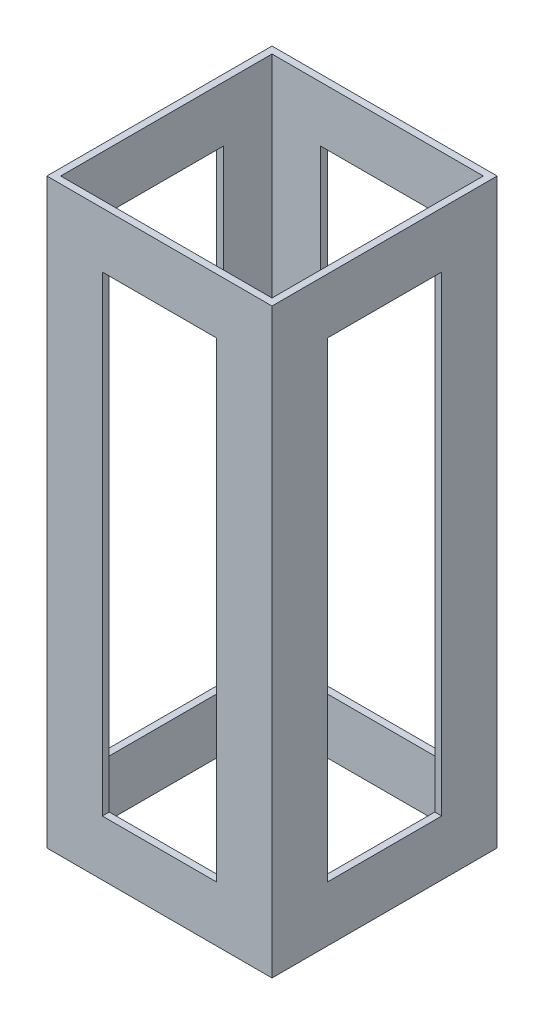
ISO-10303-21;
HEADER;
FILE_DESCRIPTION(('STEP AP214'),'2;1');
FILE_NAME('part.step','',(''),(''),'','','');
FILE_SCHEMA(('AUTOMOTIVE_DESIGN { 1 0 10303 214 1 1 1 1 }'));
ENDSEC;
DATA;
#1=APPLICATION_CONTEXT('core data for automotive mechanical design processes');
#2=APPLICATION_PROTOCOL_DEFINITION('international standard','automotive_design',2000,#1);
#3=PRODUCT_CONTEXT('',#1,'mechanical');
#4=PRODUCT('Part','Part','',(#3));
#5=PRODUCT_RELATED_PRODUCT_CATEGORY('part','',(#4));
#6=PRODUCT_DEFINITION_FORMATION('','',#4);
#7=PRODUCT_DEFINITION_CONTEXT('part definition',#1,'design');
#8=PRODUCT_DEFINITION('design','',#6,#7);
#9=PRODUCT_DEFINITION_SHAPE('','',#8);
#10=(LENGTH_UNIT() NAMED_UNIT(*) SI_UNIT(.MILLI.,.METRE.));
#11=(NAMED_UNIT(*) PLANE_ANGLE_UNIT() SI_UNIT($,.RADIAN.));
#12=(NAMED_UNIT(*) SI_UNIT($,.STERADIAN.) SOLID_ANGLE_UNIT());
#13=UNCERTAINTY_MEASURE_WITH_UNIT(LENGTH_MEASURE(1.E-05),#10,'distance_accuracy_value','');
#14=(GEOMETRIC_REPRESENTATION_CONTEXT(3) GLOBAL_UNCERTAINTY_ASSIGNED_CONTEXT((#13)) GLOBAL_UNIT_ASSIGNED_CONTEXT((#10,
#11,#12)) REPRESENTATION_CONTEXT('',''));
#15=CARTESIAN_POINT('',(0.,0.,0.));
#16=DIRECTION('',(0.,0.,1.));
#17=DIRECTION('',(1.,0.,0.));
#18=AXIS2_PLACEMENT_3D('',#15,#16,#17);
#19=CARTESIAN_POINT('',(0.,266.7,0.));
#20=DIRECTION('',(0.,-1.,0.));
#21=DIRECTION('',(0.,0.,-1.));
#22=AXIS2_PLACEMENT_3D('',#19,#20,#21);
#23=PLANE('',#22);
#24=DIRECTION('',(0.,0.,-1.));
#25=VECTOR('',#24,1.);
#26=CARTESIAN_POINT('',(51.59375,266.7,51.59375));
#27=LINE('',#26,#25);
#28=CARTESIAN_POINT('',(51.59375,266.7,51.59375));
#29=VERTEX_POINT('',#28);
#30=CARTESIAN_POINT('',(51.59375,266.7,-51.59375));
#31=VERTEX_POINT('',#30);
#32=EDGE_CURVE('E381',#29,#31,#27,.T.);
#33=ORIENTED_EDGE('',*,*,#32,.T.);
#34=DIRECTION('',(-1.,0.,0.));
#35=VECTOR('',#34,1.);
#36=CARTESIAN_POINT('',(-51.59375,266.7,-51.59375));
#37=LINE('',#36,#35);
#38=CARTESIAN_POINT('',(-51.59375,266.7,-51.59375));
#39=VERTEX_POINT('',#38);
#40=EDGE_CURVE('E385',#31,#39,#37,.T.);
#41=ORIENTED_EDGE('',*,*,#40,.T.);
#42=DIRECTION('',(0.,0.,1.));
#43=VECTOR('',#42,1.);
#44=CARTESIAN_POINT('',(-51.59375,266.7,51.59375));
#45=LINE('',#44,#43);
#46=CARTESIAN_POINT('',(-51.59375,266.7,51.59375));
#47=VERTEX_POINT('',#46);
#48=EDGE_CURVE('E389',#39,#47,#45,.T.);
#49=ORIENTED_EDGE('',*,*,#48,.T.);
#50=DIRECTION('',(1.,0.,0.));
#51=VECTOR('',#50,1.);
#52=CARTESIAN_POINT('',(-51.59375,266.7,51.59375));
#53=LINE('',#52,#51);
#54=EDGE_CURVE('E392',#47,#29,#53,.T.);
#55=ORIENTED_EDGE('',*,*,#54,.T.);
#56=EDGE_LOOP('',(#33,#41,#49,#55));
#57=FACE_BOUND('',#56,.T.);
#58=DIRECTION('',(0.,0.,1.));
#59=VECTOR('',#58,1.);
#60=CARTESIAN_POINT('',(-48.41875,266.7,48.41875));
#61=LINE('',#60,#59);
#62=CARTESIAN_POINT('',(-48.41875,266.7,-48.41875));
#63=VERTEX_POINT('',#62);
#64=CARTESIAN_POINT('',(-48.41875,266.7,48.41875));
#65=VERTEX_POINT('',#64);
#66=EDGE_CURVE('E338',#63,#65,#61,.T.);
#67=ORIENTED_EDGE('',*,*,#66,.F.);
#68=DIRECTION('',(-1.,0.,0.));
#69=VECTOR('',#68,1.);
#70=CARTESIAN_POINT('',(-48.41875,266.7,-48.41875));
#71=LINE('',#70,#69);
#72=CARTESIAN_POINT('',(48.41875,266.7,-48.41875));
#73=VERTEX_POINT('',#72);
#74=EDGE_CURVE('E349',#73,#63,#71,.T.);
#75=ORIENTED_EDGE('',*,*,#74,.F.);
#76=DIRECTION('',(0.,0.,-1.));
#77=VECTOR('',#76,1.);
#78=CARTESIAN_POINT('',(48.41875,266.7,48.41875));
#79=LINE('',#78,#77);
#80=CARTESIAN_POINT('',(48.41875,266.7,48.41875));
#81=VERTEX_POINT('',#80);
#82=EDGE_CURVE('E345',#81,#73,#79,.T.);
#83=ORIENTED_EDGE('',*,*,#82,.F.);
#84=DIRECTION('',(1.,0.,0.));
#85=VECTOR('',#84,1.);
#86=CARTESIAN_POINT('',(-48.41875,266.7,48.41875));
#87=LINE('',#86,#85);
#88=EDGE_CURVE('E341',#65,#81,#87,.T.);
#89=ORIENTED_EDGE('',*,*,#88,.F.);
#90=EDGE_LOOP('',(#67,#75,#83,#89));
#91=FACE_BOUND('',#90,.T.);
#92=ADVANCED_FACE('F40',(#57,#91),#23,.F.);
#93=CARTESIAN_POINT('',(0.,0.,0.));
#94=DIRECTION('',(0.,-1.,0.));
#95=DIRECTION('',(0.,0.,-1.));
#96=AXIS2_PLACEMENT_3D('',#93,#94,#95);
#97=PLANE('',#96);
#98=DIRECTION('',(0.,0.,-1.));
#99=VECTOR('',#98,1.);
#100=CARTESIAN_POINT('',(51.59375,0.,51.59375));
#101=LINE('',#100,#99);
#102=CARTESIAN_POINT('',(51.59375,0.,51.59375));
#103=VERTEX_POINT('',#102);
#104=CARTESIAN_POINT('',(51.59375,0.,-51.59375));
#105=VERTEX_POINT('',#104);
#106=EDGE_CURVE('E380',#103,#105,#101,.T.);
#107=ORIENTED_EDGE('',*,*,#106,.F.);
#108=DIRECTION('',(1.,0.,0.));
#109=VECTOR('',#108,1.);
#110=CARTESIAN_POINT('',(-51.59375,0.,51.59375));
#111=LINE('',#110,#109);
#112=CARTESIAN_POINT('',(-51.59375,0.,51.59375));
#113=VERTEX_POINT('',#112);
#114=EDGE_CURVE('E386',#113,#103,#111,.T.);
#115=ORIENTED_EDGE('',*,*,#114,.F.);
#116=DIRECTION('',(0.,0.,1.));
#117=VECTOR('',#116,1.);
#118=CARTESIAN_POINT('',(-51.59375,0.,51.59375));
#119=LINE('',#118,#117);
#120=CARTESIAN_POINT('',(-51.59375,0.,-51.59375));
#121=VERTEX_POINT('',#120);
#122=EDGE_CURVE('E402',#121,#113,#119,.T.);
#123=ORIENTED_EDGE('',*,*,#122,.F.);
#124=DIRECTION('',(-1.,0.,0.));
#125=VECTOR('',#124,1.);
#126=CARTESIAN_POINT('',(-51.59375,0.,-51.59375));
#127=LINE('',#126,#125);
#128=EDGE_CURVE('E399',#105,#121,#127,.T.);
#129=ORIENTED_EDGE('',*,*,#128,.F.);
#130=EDGE_LOOP('',(#107,#115,#123,#129));
#131=FACE_BOUND('',#130,.T.);
#132=DIRECTION('',(-1.,0.,0.));
#133=VECTOR('',#132,1.);
#134=CARTESIAN_POINT('',(-48.41875,0.,-48.41875));
#135=LINE('',#134,#133);
#136=CARTESIAN_POINT('',(48.41875,0.,-48.41875));
#137=VERTEX_POINT('',#136);
#138=CARTESIAN_POINT('',(-48.41875,0.,-48.41875));
#139=VERTEX_POINT('',#138);
#140=EDGE_CURVE('E342',#137,#139,#135,.T.);
#141=ORIENTED_EDGE('',*,*,#140,.T.);
#142=DIRECTION('',(0.,0.,1.));
#143=VECTOR('',#142,1.);
#144=CARTESIAN_POINT('',(-48.41875,0.,48.41875));
#145=LINE('',#144,#143);
#146=CARTESIAN_POINT('',(-48.41875,0.,48.41875));
#147=VERTEX_POINT('',#146);
#148=EDGE_CURVE('E337',#139,#147,#145,.T.);
#149=ORIENTED_EDGE('',*,*,#148,.T.);
#150=DIRECTION('',(1.,0.,0.));
#151=VECTOR('',#150,1.);
#152=CARTESIAN_POINT('',(-48.41875,0.,48.41875));
#153=LINE('',#152,#151);
#154=CARTESIAN_POINT('',(48.41875,0.,48.41875));
#155=VERTEX_POINT('',#154);
#156=EDGE_CURVE('E356',#147,#155,#153,.T.);
#157=ORIENTED_EDGE('',*,*,#156,.T.);
#158=DIRECTION('',(0.,0.,-1.));
#159=VECTOR('',#158,1.);
#160=CARTESIAN_POINT('',(48.41875,0.,48.41875));
#161=LINE('',#160,#159);
#162=EDGE_CURVE('E360',#155,#137,#161,.T.);
#163=ORIENTED_EDGE('',*,*,#162,.T.);
#164=EDGE_LOOP('',(#141,#149,#157,#163));
#165=FACE_BOUND('',#164,.T.);
#166=ADVANCED_FACE('F496',(#131,#165),#97,.T.);
#167=CARTESIAN_POINT('',(51.59375,266.7,51.59375));
#168=DIRECTION('',(-1.,0.,0.));
#169=DIRECTION('',(0.,0.,1.));
#170=AXIS2_PLACEMENT_3D('',#167,#168,#169);
#171=PLANE('',#170);
#172=DIRECTION('',(0.,0.,-1.));
#173=VECTOR('',#172,1.);
#174=CARTESIAN_POINT('',(51.59375,25.4,26.19375));
#175=LINE('',#174,#173);
#176=CARTESIAN_POINT('',(51.59375,25.4,26.19375));
#177=VERTEX_POINT('',#176);
#178=CARTESIAN_POINT('',(51.59375,25.4,-26.19375));
#179=VERTEX_POINT('',#178);
#180=EDGE_CURVE('E219',#177,#179,#175,.T.);
#181=ORIENTED_EDGE('',*,*,#180,.F.);
#182=DIRECTION('',(0.,-1.,0.));
#183=VECTOR('',#182,1.);
#184=CARTESIAN_POINT('',(51.59375,241.3,26.19375));
#185=LINE('',#184,#183);
#186=CARTESIAN_POINT('',(51.59375,241.3,26.19375));
#187=VERTEX_POINT('',#186);
#188=EDGE_CURVE('E56',#187,#177,#185,.T.);
#189=ORIENTED_EDGE('',*,*,#188,.F.);
#190=DIRECTION('',(0.,0.,1.));
#191=VECTOR('',#190,1.);
#192=CARTESIAN_POINT('',(51.59375,241.3,-26.19375));
#193=LINE('',#192,#191);
#194=CARTESIAN_POINT('',(51.59375,241.3,-26.19375));
#195=VERTEX_POINT('',#194);
#196=EDGE_CURVE('E227',#195,#187,#193,.T.);
#197=ORIENTED_EDGE('',*,*,#196,.F.);
#198=DIRECTION('',(0.,1.,0.));
#199=VECTOR('',#198,1.);
#200=CARTESIAN_POINT('',(51.59375,25.4,-26.19375));
#201=LINE('',#200,#199);
#202=EDGE_CURVE('E208',#179,#195,#201,.T.);
#203=ORIENTED_EDGE('',*,*,#202,.F.);
#204=EDGE_LOOP('',(#181,#189,#197,#203));
#205=FACE_BOUND('',#204,.T.);
#206=ORIENTED_EDGE('',*,*,#106,.T.);
#207=DIRECTION('',(0.,-1.,0.));
#208=VECTOR('',#207,1.);
#209=CARTESIAN_POINT('',(51.59375,266.7,-51.59375));
#210=LINE('',#209,#208);
#211=EDGE_CURVE('E418',#31,#105,#210,.T.);
#212=ORIENTED_EDGE('',*,*,#211,.F.);
#213=ORIENTED_EDGE('',*,*,#32,.F.);
#214=DIRECTION('',(0.,-1.,0.));
#215=VECTOR('',#214,1.);
#216=CARTESIAN_POINT('',(51.59375,266.7,51.59375));
#217=LINE('',#216,#215);
#218=EDGE_CURVE('E395',#29,#103,#217,.T.);
#219=ORIENTED_EDGE('',*,*,#218,.T.);
#220=EDGE_LOOP('',(#206,#212,#213,#219));
#221=FACE_BOUND('',#220,.T.);
#222=ADVANCED_FACE('F42',(#205,#221),#171,.F.);
#223=CARTESIAN_POINT('',(-51.59375,266.7,-51.59375));
#224=DIRECTION('',(0.,0.,1.));
#225=DIRECTION('',(1.,0.,0.));
#226=AXIS2_PLACEMENT_3D('',#223,#224,#225);
#227=PLANE('',#226);
#228=DIRECTION('',(1.,0.,0.));
#229=VECTOR('',#228,1.);
#230=CARTESIAN_POINT('',(-26.19375,25.4,-51.59375));
#231=LINE('',#230,#229);
#232=CARTESIAN_POINT('',(-26.19375,25.4,-51.59375));
#233=VERTEX_POINT('',#232);
#234=CARTESIAN_POINT('',(26.19375,25.4,-51.59375));
#235=VERTEX_POINT('',#234);
#236=EDGE_CURVE('E301',#233,#235,#231,.T.);
#237=ORIENTED_EDGE('',*,*,#236,.T.);
#238=DIRECTION('',(0.,1.,0.));
#239=VECTOR('',#238,1.);
#240=CARTESIAN_POINT('',(26.19375,25.4,-51.59375));
#241=LINE('',#240,#239);
#242=CARTESIAN_POINT('',(26.19375,241.3,-51.59375));
#243=VERTEX_POINT('',#242);
#244=EDGE_CURVE('E289',#235,#243,#241,.T.);
#245=ORIENTED_EDGE('',*,*,#244,.T.);
#246=DIRECTION('',(-1.,0.,0.));
#247=VECTOR('',#246,1.);
#248=CARTESIAN_POINT('',(26.19375,241.3,-51.59375));
#249=LINE('',#248,#247);
#250=CARTESIAN_POINT('',(-26.19375,241.3,-51.59375));
#251=VERTEX_POINT('',#250);
#252=EDGE_CURVE('E293',#243,#251,#249,.T.);
#253=ORIENTED_EDGE('',*,*,#252,.T.);
#254=DIRECTION('',(0.,-1.,0.));
#255=VECTOR('',#254,1.);
#256=CARTESIAN_POINT('',(-26.19375,241.3,-51.59375));
#257=LINE('',#256,#255);
#258=EDGE_CURVE('E297',#251,#233,#257,.T.);
#259=ORIENTED_EDGE('',*,*,#258,.T.);
#260=EDGE_LOOP('',(#237,#245,#253,#259));
#261=FACE_BOUND('',#260,.T.);
#262=ORIENTED_EDGE('',*,*,#128,.T.);
#263=DIRECTION('',(0.,-1.,0.));
#264=VECTOR('',#263,1.);
#265=CARTESIAN_POINT('',(-51.59375,266.7,-51.59375));
#266=LINE('',#265,#264);
#267=EDGE_CURVE('E414',#39,#121,#266,.T.);
#268=ORIENTED_EDGE('',*,*,#267,.F.);
#269=ORIENTED_EDGE('',*,*,#40,.F.);
#270=ORIENTED_EDGE('',*,*,#211,.T.);
#271=EDGE_LOOP('',(#262,#268,#269,#270));
#272=FACE_BOUND('',#271,.T.);
#273=ADVANCED_FACE('F513',(#261,#272),#227,.F.);
#274=CARTESIAN_POINT('',(-51.59375,266.7,51.59375));
#275=DIRECTION('',(1.,0.,0.));
#276=DIRECTION('',(0.,0.,-1.));
#277=AXIS2_PLACEMENT_3D('',#274,#275,#276);
#278=PLANE('',#277);
#279=DIRECTION('',(0.,0.,1.));
#280=VECTOR('',#279,1.);
#281=CARTESIAN_POINT('',(-51.59375,241.3,-26.19375));
#282=LINE('',#281,#280);
#283=CARTESIAN_POINT('',(-51.59375,241.3,-26.19375));
#284=VERTEX_POINT('',#283);
#285=CARTESIAN_POINT('',(-51.59375,241.3,26.19375));
#286=VERTEX_POINT('',#285);
#287=EDGE_CURVE('E244',#284,#286,#282,.T.);
#288=ORIENTED_EDGE('',*,*,#287,.T.);
#289=DIRECTION('',(0.,-1.,0.));
#290=VECTOR('',#289,1.);
#291=CARTESIAN_POINT('',(-51.59375,241.3,26.19375));
#292=LINE('',#291,#290);
#293=CARTESIAN_POINT('',(-51.59375,25.4,26.19375));
#294=VERTEX_POINT('',#293);
#295=EDGE_CURVE('E231',#286,#294,#292,.T.);
#296=ORIENTED_EDGE('',*,*,#295,.T.);
#297=DIRECTION('',(0.,0.,-1.));
#298=VECTOR('',#297,1.);
#299=CARTESIAN_POINT('',(-51.59375,25.4,26.19375));
#300=LINE('',#299,#298);
#301=CARTESIAN_POINT('',(-51.59375,25.4,-26.19375));
#302=VERTEX_POINT('',#301);
#303=EDGE_CURVE('E238',#294,#302,#300,.T.);
#304=ORIENTED_EDGE('',*,*,#303,.T.);
#305=DIRECTION('',(0.,1.,0.));
#306=VECTOR('',#305,1.);
#307=CARTESIAN_POINT('',(-51.59375,25.4,-26.19375));
#308=LINE('',#307,#306);
#309=EDGE_CURVE('E64',#302,#284,#308,.T.);
#310=ORIENTED_EDGE('',*,*,#309,.T.);
#311=EDGE_LOOP('',(#288,#296,#304,#310));
#312=FACE_BOUND('',#311,.T.);
#313=ORIENTED_EDGE('',*,*,#122,.T.);
#314=DIRECTION('',(0.,-1.,0.));
#315=VECTOR('',#314,1.);
#316=CARTESIAN_POINT('',(-51.59375,266.7,51.59375));
#317=LINE('',#316,#315);
#318=EDGE_CURVE('E410',#47,#113,#317,.T.);
#319=ORIENTED_EDGE('',*,*,#318,.F.);
#320=ORIENTED_EDGE('',*,*,#48,.F.);
#321=ORIENTED_EDGE('',*,*,#267,.T.);
#322=EDGE_LOOP('',(#313,#319,#320,#321));
#323=FACE_BOUND('',#322,.T.);
#324=ADVANCED_FACE('F511',(#312,#323),#278,.F.);
#325=CARTESIAN_POINT('',(-51.59375,266.7,51.59375));
#326=DIRECTION('',(0.,0.,-1.));
#327=DIRECTION('',(-1.,0.,0.));
#328=AXIS2_PLACEMENT_3D('',#325,#326,#327);
#329=PLANE('',#328);
#330=DIRECTION('',(-1.,0.,0.));
#331=VECTOR('',#330,1.);
#332=CARTESIAN_POINT('',(26.19375,241.3,51.59375));
#333=LINE('',#332,#331);
#334=CARTESIAN_POINT('',(26.19375,241.3,51.59375));
#335=VERTEX_POINT('',#334);
#336=CARTESIAN_POINT('',(-26.19375,241.3,51.59375));
#337=VERTEX_POINT('',#336);
#338=EDGE_CURVE('E277',#335,#337,#333,.T.);
#339=ORIENTED_EDGE('',*,*,#338,.F.);
#340=DIRECTION('',(0.,1.,0.));
#341=VECTOR('',#340,1.);
#342=CARTESIAN_POINT('',(26.19375,25.4,51.59375));
#343=LINE('',#342,#341);
#344=CARTESIAN_POINT('',(26.19375,25.4,51.59375));
#345=VERTEX_POINT('',#344);
#346=EDGE_CURVE('E274',#345,#335,#343,.T.);
#347=ORIENTED_EDGE('',*,*,#346,.F.);
#348=DIRECTION('',(1.,0.,0.));
#349=VECTOR('',#348,1.);
#350=CARTESIAN_POINT('',(-26.19375,25.4,51.59375));
#351=LINE('',#350,#349);
#352=CARTESIAN_POINT('',(-26.19375,25.4,51.59375));
#353=VERTEX_POINT('',#352);
#354=EDGE_CURVE('E285',#353,#345,#351,.T.);
#355=ORIENTED_EDGE('',*,*,#354,.F.);
#356=DIRECTION('',(0.,-1.,0.));
#357=VECTOR('',#356,1.);
#358=CARTESIAN_POINT('',(-26.19375,241.3,51.59375));
#359=LINE('',#358,#357);
#360=EDGE_CURVE('E281',#337,#353,#359,.T.);
#361=ORIENTED_EDGE('',*,*,#360,.F.);
#362=EDGE_LOOP('',(#339,#347,#355,#361));
#363=FACE_BOUND('',#362,.T.);
#364=ORIENTED_EDGE('',*,*,#114,.T.);
#365=ORIENTED_EDGE('',*,*,#218,.F.);
#366=ORIENTED_EDGE('',*,*,#54,.F.);
#367=ORIENTED_EDGE('',*,*,#318,.T.);
#368=EDGE_LOOP('',(#364,#365,#366,#367));
#369=FACE_BOUND('',#368,.T.);
#370=ADVANCED_FACE('F471',(#363,#369),#329,.F.);
#371=CARTESIAN_POINT('',(-48.41875,266.7,48.41875));
#372=DIRECTION('',(1.,0.,0.));
#373=DIRECTION('',(0.,0.,-1.));
#374=AXIS2_PLACEMENT_3D('',#371,#372,#373);
#375=PLANE('',#374);
#376=DIRECTION('',(0.,-1.,0.));
#377=VECTOR('',#376,1.);
#378=CARTESIAN_POINT('',(-48.41875,266.7,26.19375));
#379=LINE('',#378,#377);
#380=CARTESIAN_POINT('',(-48.41875,241.3,26.19375));
#381=VERTEX_POINT('',#380);
#382=CARTESIAN_POINT('',(-48.41875,25.4,26.19375));
#383=VERTEX_POINT('',#382);
#384=EDGE_CURVE('E270',#381,#383,#379,.T.);
#385=ORIENTED_EDGE('',*,*,#384,.F.);
#386=DIRECTION('',(0.,0.,1.));
#387=VECTOR('',#386,1.);
#388=CARTESIAN_POINT('',(-48.41875,241.3,48.41875));
#389=LINE('',#388,#387);
#390=CARTESIAN_POINT('',(-48.41875,241.3,-26.19375));
#391=VERTEX_POINT('',#390);
#392=EDGE_CURVE('E267',#391,#381,#389,.T.);
#393=ORIENTED_EDGE('',*,*,#392,.F.);
#394=DIRECTION('',(0.,1.,0.));
#395=VECTOR('',#394,1.);
#396=CARTESIAN_POINT('',(-48.41875,266.7,-26.19375));
#397=LINE('',#396,#395);
#398=CARTESIAN_POINT('',(-48.41875,25.4,-26.19375));
#399=VERTEX_POINT('',#398);
#400=EDGE_CURVE('E264',#399,#391,#397,.T.);
#401=ORIENTED_EDGE('',*,*,#400,.F.);
#402=DIRECTION('',(0.,0.,-1.));
#403=VECTOR('',#402,1.);
#404=CARTESIAN_POINT('',(-48.41875,25.4,48.41875));
#405=LINE('',#404,#403);
#406=EDGE_CURVE('E252',#383,#399,#405,.T.);
#407=ORIENTED_EDGE('',*,*,#406,.F.);
#408=EDGE_LOOP('',(#385,#393,#401,#407));
#409=FACE_BOUND('',#408,.T.);
#410=ORIENTED_EDGE('',*,*,#148,.F.);
#411=DIRECTION('',(0.,-1.,0.));
#412=VECTOR('',#411,1.);
#413=CARTESIAN_POINT('',(-48.41875,266.7,-48.41875));
#414=LINE('',#413,#412);
#415=EDGE_CURVE('E352',#63,#139,#414,.T.);
#416=ORIENTED_EDGE('',*,*,#415,.F.);
#417=ORIENTED_EDGE('',*,*,#66,.T.);
#418=DIRECTION('',(0.,-1.,0.));
#419=VECTOR('',#418,1.);
#420=CARTESIAN_POINT('',(-48.41875,266.7,48.41875));
#421=LINE('',#420,#419);
#422=EDGE_CURVE('E376',#65,#147,#421,.T.);
#423=ORIENTED_EDGE('',*,*,#422,.T.);
#424=EDGE_LOOP('',(#410,#416,#417,#423));
#425=FACE_BOUND('',#424,.T.);
#426=ADVANCED_FACE('F506',(#409,#425),#375,.T.);
#427=CARTESIAN_POINT('',(-48.41875,266.7,48.41875));
#428=DIRECTION('',(0.,0.,-1.));
#429=DIRECTION('',(-1.,0.,0.));
#430=AXIS2_PLACEMENT_3D('',#427,#428,#429);
#431=PLANE('',#430);
#432=DIRECTION('',(0.,-1.,0.));
#433=VECTOR('',#432,1.);
#434=CARTESIAN_POINT('',(26.19375,266.7,48.41875));
#435=LINE('',#434,#433);
#436=CARTESIAN_POINT('',(26.19375,241.3,48.41875));
#437=VERTEX_POINT('',#436);
#438=CARTESIAN_POINT('',(26.19375,25.4,48.41875));
#439=VERTEX_POINT('',#438);
#440=EDGE_CURVE('E334',#437,#439,#435,.T.);
#441=ORIENTED_EDGE('',*,*,#440,.F.);
#442=DIRECTION('',(1.,0.,0.));
#443=VECTOR('',#442,1.);
#444=CARTESIAN_POINT('',(-48.41875,241.3,48.41875));
#445=LINE('',#444,#443);
#446=CARTESIAN_POINT('',(-26.19375,241.3,48.41875));
#447=VERTEX_POINT('',#446);
#448=EDGE_CURVE('E310',#447,#437,#445,.T.);
#449=ORIENTED_EDGE('',*,*,#448,.F.);
#450=DIRECTION('',(0.,1.,0.));
#451=VECTOR('',#450,1.);
#452=CARTESIAN_POINT('',(-26.19375,266.7,48.41875));
#453=LINE('',#452,#451);
#454=CARTESIAN_POINT('',(-26.19375,25.4,48.41875));
#455=VERTEX_POINT('',#454);
#456=EDGE_CURVE('E327',#455,#447,#453,.T.);
#457=ORIENTED_EDGE('',*,*,#456,.F.);
#458=DIRECTION('',(-1.,0.,0.));
#459=VECTOR('',#458,1.);
#460=CARTESIAN_POINT('',(-48.41875,25.4,48.41875));
#461=LINE('',#460,#459);
#462=EDGE_CURVE('E331',#439,#455,#461,.T.);
#463=ORIENTED_EDGE('',*,*,#462,.F.);
#464=EDGE_LOOP('',(#441,#449,#457,#463));
#465=FACE_BOUND('',#464,.T.);
#466=ORIENTED_EDGE('',*,*,#156,.F.);
#467=ORIENTED_EDGE('',*,*,#422,.F.);
#468=ORIENTED_EDGE('',*,*,#88,.T.);
#469=DIRECTION('',(0.,-1.,0.));
#470=VECTOR('',#469,1.);
#471=CARTESIAN_POINT('',(48.41875,266.7,48.41875));
#472=LINE('',#471,#470);
#473=EDGE_CURVE('E373',#81,#155,#472,.T.);
#474=ORIENTED_EDGE('',*,*,#473,.T.);
#475=EDGE_LOOP('',(#466,#467,#468,#474));
#476=FACE_BOUND('',#475,.T.);
#477=ADVANCED_FACE('F477',(#465,#476),#431,.T.);
#478=CARTESIAN_POINT('',(48.41875,266.7,48.41875));
#479=DIRECTION('',(-1.,0.,0.));
#480=DIRECTION('',(0.,0.,1.));
#481=AXIS2_PLACEMENT_3D('',#478,#479,#480);
#482=PLANE('',#481);
#483=DIRECTION('',(0.,1.,0.));
#484=VECTOR('',#483,1.);
#485=CARTESIAN_POINT('',(48.41875,266.7,26.19375));
#486=LINE('',#485,#484);
#487=CARTESIAN_POINT('',(48.41875,25.4,26.19375));
#488=VERTEX_POINT('',#487);
#489=CARTESIAN_POINT('',(48.41875,241.3,26.19375));
#490=VERTEX_POINT('',#489);
#491=EDGE_CURVE('E11',#488,#490,#486,.T.);
#492=ORIENTED_EDGE('',*,*,#491,.F.);
#493=DIRECTION('',(0.,0.,1.));
#494=VECTOR('',#493,1.);
#495=CARTESIAN_POINT('',(48.41875,25.4,48.41875));
#496=LINE('',#495,#494);
#497=CARTESIAN_POINT('',(48.41875,25.4,-26.19375));
#498=VERTEX_POINT('',#497);
#499=EDGE_CURVE('E435',#498,#488,#496,.T.);
#500=ORIENTED_EDGE('',*,*,#499,.F.);
#501=DIRECTION('',(0.,-1.,0.));
#502=VECTOR('',#501,1.);
#503=CARTESIAN_POINT('',(48.41875,266.7,-26.19375));
#504=LINE('',#503,#502);
#505=CARTESIAN_POINT('',(48.41875,241.3,-26.19375));
#506=VERTEX_POINT('',#505);
#507=EDGE_CURVE('E211',#506,#498,#504,.T.);
#508=ORIENTED_EDGE('',*,*,#507,.F.);
#509=DIRECTION('',(0.,0.,-1.));
#510=VECTOR('',#509,1.);
#511=CARTESIAN_POINT('',(48.41875,241.3,48.41875));
#512=LINE('',#511,#510);
#513=EDGE_CURVE('E49',#490,#506,#512,.T.);
#514=ORIENTED_EDGE('',*,*,#513,.F.);
#515=EDGE_LOOP('',(#492,#500,#508,#514));
#516=FACE_BOUND('',#515,.T.);
#517=ORIENTED_EDGE('',*,*,#162,.F.);
#518=ORIENTED_EDGE('',*,*,#473,.F.);
#519=ORIENTED_EDGE('',*,*,#82,.T.);
#520=DIRECTION('',(0.,-1.,0.));
#521=VECTOR('',#520,1.);
#522=CARTESIAN_POINT('',(48.41875,266.7,-48.41875));
#523=LINE('',#522,#521);
#524=EDGE_CURVE('E370',#73,#137,#523,.T.);
#525=ORIENTED_EDGE('',*,*,#524,.T.);
#526=EDGE_LOOP('',(#517,#518,#519,#525));
#527=FACE_BOUND('',#526,.T.);
#528=ADVANCED_FACE('F447',(#516,#527),#482,.T.);
#529=CARTESIAN_POINT('',(-48.41875,266.7,-48.41875));
#530=DIRECTION('',(0.,0.,1.));
#531=DIRECTION('',(1.,0.,0.));
#532=AXIS2_PLACEMENT_3D('',#529,#530,#531);
#533=PLANE('',#532);
#534=DIRECTION('',(0.,1.,0.));
#535=VECTOR('',#534,1.);
#536=CARTESIAN_POINT('',(26.19375,266.7,-48.41875));
#537=LINE('',#536,#535);
#538=CARTESIAN_POINT('',(26.19375,25.4,-48.41875));
#539=VERTEX_POINT('',#538);
#540=CARTESIAN_POINT('',(26.19375,241.3,-48.41875));
#541=VERTEX_POINT('',#540);
#542=EDGE_CURVE('E431',#539,#541,#537,.T.);
#543=ORIENTED_EDGE('',*,*,#542,.F.);
#544=DIRECTION('',(1.,0.,0.));
#545=VECTOR('',#544,1.);
#546=CARTESIAN_POINT('',(-48.41875,25.4,-48.41875));
#547=LINE('',#546,#545);
#548=CARTESIAN_POINT('',(-26.19375,25.4,-48.41875));
#549=VERTEX_POINT('',#548);
#550=EDGE_CURVE('E428',#549,#539,#547,.T.);
#551=ORIENTED_EDGE('',*,*,#550,.F.);
#552=DIRECTION('',(0.,-1.,0.));
#553=VECTOR('',#552,1.);
#554=CARTESIAN_POINT('',(-26.19375,266.7,-48.41875));
#555=LINE('',#554,#553);
#556=CARTESIAN_POINT('',(-26.19375,241.3,-48.41875));
#557=VERTEX_POINT('',#556);
#558=EDGE_CURVE('E425',#557,#549,#555,.T.);
#559=ORIENTED_EDGE('',*,*,#558,.F.);
#560=DIRECTION('',(-1.,0.,0.));
#561=VECTOR('',#560,1.);
#562=CARTESIAN_POINT('',(-48.41875,241.3,-48.41875));
#563=LINE('',#562,#561);
#564=EDGE_CURVE('E422',#541,#557,#563,.T.);
#565=ORIENTED_EDGE('',*,*,#564,.F.);
#566=EDGE_LOOP('',(#543,#551,#559,#565));
#567=FACE_BOUND('',#566,.T.);
#568=ORIENTED_EDGE('',*,*,#140,.F.);
#569=ORIENTED_EDGE('',*,*,#524,.F.);
#570=ORIENTED_EDGE('',*,*,#74,.T.);
#571=ORIENTED_EDGE('',*,*,#415,.T.);
#572=EDGE_LOOP('',(#568,#569,#570,#571));
#573=FACE_BOUND('',#572,.T.);
#574=ADVANCED_FACE('F538',(#567,#573),#533,.T.);
#575=CARTESIAN_POINT('',(26.19375,241.3,-51.59375));
#576=DIRECTION('',(0.,1.,0.));
#577=DIRECTION('',(0.,0.,1.));
#578=AXIS2_PLACEMENT_3D('',#575,#576,#577);
#579=PLANE('',#578);
#580=ORIENTED_EDGE('',*,*,#564,.T.);
#581=DIRECTION('',(0.,0.,1.));
#582=VECTOR('',#581,1.);
#583=CARTESIAN_POINT('',(-26.19375,241.3,-51.59375));
#584=LINE('',#583,#582);
#585=EDGE_CURVE('E317',#251,#557,#584,.T.);
#586=ORIENTED_EDGE('',*,*,#585,.F.);
#587=ORIENTED_EDGE('',*,*,#252,.F.);
#588=DIRECTION('',(0.,0.,1.));
#589=VECTOR('',#588,1.);
#590=CARTESIAN_POINT('',(26.19375,241.3,-51.59375));
#591=LINE('',#590,#589);
#592=EDGE_CURVE('E322',#243,#541,#591,.T.);
#593=ORIENTED_EDGE('',*,*,#592,.T.);
#594=EDGE_LOOP('',(#580,#586,#587,#593));
#595=FACE_BOUND('',#594,.T.);
#596=ADVANCED_FACE('F490',(#595),#579,.F.);
#597=CARTESIAN_POINT('',(-26.19375,241.3,-51.59375));
#598=DIRECTION('',(-1.,0.,0.));
#599=DIRECTION('',(0.,0.,1.));
#600=AXIS2_PLACEMENT_3D('',#597,#598,#599);
#601=PLANE('',#600);
#602=ORIENTED_EDGE('',*,*,#558,.T.);
#603=DIRECTION('',(0.,0.,1.));
#604=VECTOR('',#603,1.);
#605=CARTESIAN_POINT('',(-26.19375,25.4,-51.59375));
#606=LINE('',#605,#604);
#607=EDGE_CURVE('E312',#233,#549,#606,.T.);
#608=ORIENTED_EDGE('',*,*,#607,.F.);
#609=ORIENTED_EDGE('',*,*,#258,.F.);
#610=ORIENTED_EDGE('',*,*,#585,.T.);
#611=EDGE_LOOP('',(#602,#608,#609,#610));
#612=FACE_BOUND('',#611,.T.);
#613=ADVANCED_FACE('F484',(#612),#601,.F.);
#614=CARTESIAN_POINT('',(-26.19375,25.4,-51.59375));
#615=DIRECTION('',(0.,-1.,0.));
#616=DIRECTION('',(0.,0.,-1.));
#617=AXIS2_PLACEMENT_3D('',#614,#615,#616);
#618=PLANE('',#617);
#619=ORIENTED_EDGE('',*,*,#550,.T.);
#620=DIRECTION('',(0.,0.,1.));
#621=VECTOR('',#620,1.);
#622=CARTESIAN_POINT('',(26.19375,25.4,-51.59375));
#623=LINE('',#622,#621);
#624=EDGE_CURVE('E306',#235,#539,#623,.T.);
#625=ORIENTED_EDGE('',*,*,#624,.F.);
#626=ORIENTED_EDGE('',*,*,#236,.F.);
#627=ORIENTED_EDGE('',*,*,#607,.T.);
#628=EDGE_LOOP('',(#619,#625,#626,#627));
#629=FACE_BOUND('',#628,.T.);
#630=ADVANCED_FACE('F492',(#629),#618,.F.);
#631=CARTESIAN_POINT('',(26.19375,25.4,-51.59375));
#632=DIRECTION('',(1.,0.,0.));
#633=DIRECTION('',(0.,0.,-1.));
#634=AXIS2_PLACEMENT_3D('',#631,#632,#633);
#635=PLANE('',#634);
#636=ORIENTED_EDGE('',*,*,#542,.T.);
#637=ORIENTED_EDGE('',*,*,#592,.F.);
#638=ORIENTED_EDGE('',*,*,#244,.F.);
#639=ORIENTED_EDGE('',*,*,#624,.T.);
#640=EDGE_LOOP('',(#636,#637,#638,#639));
#641=FACE_BOUND('',#640,.T.);
#642=ADVANCED_FACE('F558',(#641),#635,.F.);
#643=ORIENTED_EDGE('',*,*,#440,.T.);
#644=EDGE_CURVE('E311',#439,#345,#623,.T.);
#645=ORIENTED_EDGE('',*,*,#644,.T.);
#646=ORIENTED_EDGE('',*,*,#346,.T.);
#647=EDGE_CURVE('E305',#437,#335,#591,.T.);
#648=ORIENTED_EDGE('',*,*,#647,.F.);
#649=EDGE_LOOP('',(#643,#645,#646,#648));
#650=FACE_BOUND('',#649,.T.);
#651=ADVANCED_FACE('F459',(#650),#635,.F.);
#652=ORIENTED_EDGE('',*,*,#462,.T.);
#653=EDGE_CURVE('E316',#455,#353,#606,.T.);
#654=ORIENTED_EDGE('',*,*,#653,.T.);
#655=ORIENTED_EDGE('',*,*,#354,.T.);
#656=ORIENTED_EDGE('',*,*,#644,.F.);
#657=EDGE_LOOP('',(#652,#654,#655,#656));
#658=FACE_BOUND('',#657,.T.);
#659=ADVANCED_FACE('F466',(#658),#618,.F.);
#660=ORIENTED_EDGE('',*,*,#456,.T.);
#661=EDGE_CURVE('E321',#447,#337,#584,.T.);
#662=ORIENTED_EDGE('',*,*,#661,.T.);
#663=ORIENTED_EDGE('',*,*,#360,.T.);
#664=ORIENTED_EDGE('',*,*,#653,.F.);
#665=EDGE_LOOP('',(#660,#662,#663,#664));
#666=FACE_BOUND('',#665,.T.);
#667=ADVANCED_FACE('F481',(#666),#601,.F.);
#668=ORIENTED_EDGE('',*,*,#448,.T.);
#669=ORIENTED_EDGE('',*,*,#647,.T.);
#670=ORIENTED_EDGE('',*,*,#338,.T.);
#671=ORIENTED_EDGE('',*,*,#661,.F.);
#672=EDGE_LOOP('',(#668,#669,#670,#671));
#673=FACE_BOUND('',#672,.T.);
#674=ADVANCED_FACE('F474',(#673),#579,.F.);
#675=CARTESIAN_POINT('',(-51.59375,25.4,26.19375));
#676=DIRECTION('',(0.,-1.,0.));
#677=DIRECTION('',(0.,0.,-1.));
#678=AXIS2_PLACEMENT_3D('',#675,#676,#677);
#679=PLANE('',#678);
#680=ORIENTED_EDGE('',*,*,#499,.T.);
#681=DIRECTION('',(1.,0.,0.));
#682=VECTOR('',#681,1.);
#683=CARTESIAN_POINT('',(-51.59375,25.4,26.19375));
#684=LINE('',#683,#682);
#685=EDGE_CURVE('E221',#488,#177,#684,.T.);
#686=ORIENTED_EDGE('',*,*,#685,.T.);
#687=ORIENTED_EDGE('',*,*,#180,.T.);
#688=DIRECTION('',(1.,0.,0.));
#689=VECTOR('',#688,1.);
#690=CARTESIAN_POINT('',(-51.59375,25.4,-26.19375));
#691=LINE('',#690,#689);
#692=EDGE_CURVE('E203',#498,#179,#691,.T.);
#693=ORIENTED_EDGE('',*,*,#692,.F.);
#694=EDGE_LOOP('',(#680,#686,#687,#693));
#695=FACE_BOUND('',#694,.T.);
#696=ADVANCED_FACE('F220',(#695),#679,.F.);
#697=CARTESIAN_POINT('',(-51.59375,25.4,-26.19375));
#698=DIRECTION('',(0.,0.,-1.));
#699=DIRECTION('',(-1.,0.,0.));
#700=AXIS2_PLACEMENT_3D('',#697,#698,#699);
#701=PLANE('',#700);
#702=ORIENTED_EDGE('',*,*,#507,.T.);
#703=ORIENTED_EDGE('',*,*,#692,.T.);
#704=ORIENTED_EDGE('',*,*,#202,.T.);
#705=DIRECTION('',(1.,0.,0.));
#706=VECTOR('',#705,1.);
#707=CARTESIAN_POINT('',(-51.59375,241.3,-26.19375));
#708=LINE('',#707,#706);
#709=EDGE_CURVE('E257',#506,#195,#708,.T.);
#710=ORIENTED_EDGE('',*,*,#709,.F.);
#711=EDGE_LOOP('',(#702,#703,#704,#710));
#712=FACE_BOUND('',#711,.T.);
#713=ADVANCED_FACE('F205',(#712),#701,.F.);
#714=CARTESIAN_POINT('',(-51.59375,241.3,-26.19375));
#715=DIRECTION('',(0.,1.,0.));
#716=DIRECTION('',(0.,0.,1.));
#717=AXIS2_PLACEMENT_3D('',#714,#715,#716);
#718=PLANE('',#717);
#719=ORIENTED_EDGE('',*,*,#513,.T.);
#720=ORIENTED_EDGE('',*,*,#709,.T.);
#721=ORIENTED_EDGE('',*,*,#196,.T.);
#722=DIRECTION('',(1.,0.,0.));
#723=VECTOR('',#722,1.);
#724=CARTESIAN_POINT('',(-51.59375,241.3,26.19375));
#725=LINE('',#724,#723);
#726=EDGE_CURVE('E253',#490,#187,#725,.T.);
#727=ORIENTED_EDGE('',*,*,#726,.F.);
#728=EDGE_LOOP('',(#719,#720,#721,#727));
#729=FACE_BOUND('',#728,.T.);
#730=ADVANCED_FACE('F443',(#729),#718,.F.);
#731=CARTESIAN_POINT('',(-51.59375,241.3,26.19375));
#732=DIRECTION('',(0.,0.,1.));
#733=DIRECTION('',(1.,0.,0.));
#734=AXIS2_PLACEMENT_3D('',#731,#732,#733);
#735=PLANE('',#734);
#736=ORIENTED_EDGE('',*,*,#491,.T.);
#737=ORIENTED_EDGE('',*,*,#726,.T.);
#738=ORIENTED_EDGE('',*,*,#188,.T.);
#739=ORIENTED_EDGE('',*,*,#685,.F.);
#740=EDGE_LOOP('',(#736,#737,#738,#739));
#741=FACE_BOUND('',#740,.T.);
#742=ADVANCED_FACE('F449',(#741),#735,.F.);
#743=ORIENTED_EDGE('',*,*,#384,.T.);
#744=EDGE_CURVE('E216',#294,#383,#684,.T.);
#745=ORIENTED_EDGE('',*,*,#744,.F.);
#746=ORIENTED_EDGE('',*,*,#295,.F.);
#747=EDGE_CURVE('E248',#286,#381,#725,.T.);
#748=ORIENTED_EDGE('',*,*,#747,.T.);
#749=EDGE_LOOP('',(#743,#745,#746,#748));
#750=FACE_BOUND('',#749,.T.);
#751=ADVANCED_FACE('F580',(#750),#735,.F.);
#752=ORIENTED_EDGE('',*,*,#392,.T.);
#753=ORIENTED_EDGE('',*,*,#747,.F.);
#754=ORIENTED_EDGE('',*,*,#287,.F.);
#755=EDGE_CURVE('E254',#284,#391,#708,.T.);
#756=ORIENTED_EDGE('',*,*,#755,.T.);
#757=EDGE_LOOP('',(#752,#753,#754,#756));
#758=FACE_BOUND('',#757,.T.);
#759=ADVANCED_FACE('F588',(#758),#718,.F.);
#760=ORIENTED_EDGE('',*,*,#400,.T.);
#761=ORIENTED_EDGE('',*,*,#755,.F.);
#762=ORIENTED_EDGE('',*,*,#309,.F.);
#763=EDGE_CURVE('E215',#302,#399,#691,.T.);
#764=ORIENTED_EDGE('',*,*,#763,.T.);
#765=EDGE_LOOP('',(#760,#761,#762,#764));
#766=FACE_BOUND('',#765,.T.);
#767=ADVANCED_FACE('F586',(#766),#701,.F.);
#768=ORIENTED_EDGE('',*,*,#406,.T.);
#769=ORIENTED_EDGE('',*,*,#763,.F.);
#770=ORIENTED_EDGE('',*,*,#303,.F.);
#771=ORIENTED_EDGE('',*,*,#744,.T.);
#772=EDGE_LOOP('',(#768,#769,#770,#771));
#773=FACE_BOUND('',#772,.T.);
#774=ADVANCED_FACE('F583',(#773),#679,.F.);
#775=CLOSED_SHELL('',(#92,#166,#222,#273,#324,#370,#426,#477,#528,#574,#596,#613,#630,#642,#651,
#659,#667,#674,#696,#713,#730,#742,#751,#759,#767,#774));
#776=MANIFOLD_SOLID_BREP('B2',#775);
#777=ADVANCED_BREP_SHAPE_REPRESENTATION('',(#18,#776),#14);
#778=SHAPE_DEFINITION_REPRESENTATION(#9,#777);
ENDSEC;
END-ISO-10303-21;
